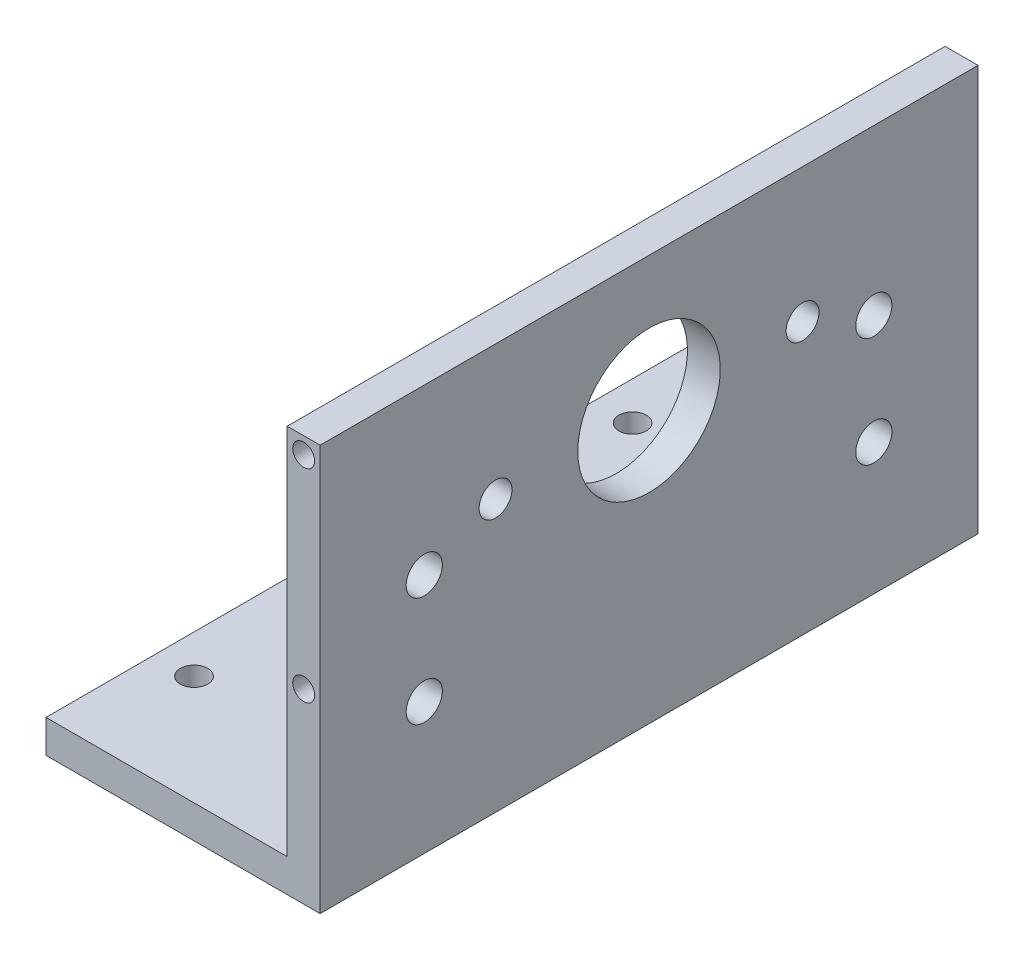
ISO-10303-21;
HEADER;
FILE_DESCRIPTION(('STEP AP214'),'2;1');
FILE_NAME('part.step','',(''),(''),'','','');
FILE_SCHEMA(('AUTOMOTIVE_DESIGN { 1 0 10303 214 1 1 1 1 }'));
ENDSEC;
DATA;
#1=APPLICATION_CONTEXT('core data for automotive mechanical design processes');
#2=APPLICATION_PROTOCOL_DEFINITION('international standard','automotive_design',2000,#1);
#3=PRODUCT_CONTEXT('',#1,'mechanical');
#4=PRODUCT('Part','Part','',(#3));
#5=PRODUCT_RELATED_PRODUCT_CATEGORY('part','',(#4));
#6=PRODUCT_DEFINITION_FORMATION('','',#4);
#7=PRODUCT_DEFINITION_CONTEXT('part definition',#1,'design');
#8=PRODUCT_DEFINITION('design','',#6,#7);
#9=PRODUCT_DEFINITION_SHAPE('','',#8);
#10=(LENGTH_UNIT() NAMED_UNIT(*) SI_UNIT(.MILLI.,.METRE.));
#11=(NAMED_UNIT(*) PLANE_ANGLE_UNIT() SI_UNIT($,.RADIAN.));
#12=(NAMED_UNIT(*) SI_UNIT($,.STERADIAN.) SOLID_ANGLE_UNIT());
#13=UNCERTAINTY_MEASURE_WITH_UNIT(LENGTH_MEASURE(1.E-05),#10,'distance_accuracy_value','');
#14=(GEOMETRIC_REPRESENTATION_CONTEXT(3) GLOBAL_UNCERTAINTY_ASSIGNED_CONTEXT((#13)) GLOBAL_UNIT_ASSIGNED_CONTEXT((#10,
#11,#12)) REPRESENTATION_CONTEXT('',''));
#15=CARTESIAN_POINT('',(0.,0.,0.));
#16=DIRECTION('',(0.,0.,1.));
#17=DIRECTION('',(1.,0.,0.));
#18=AXIS2_PLACEMENT_3D('',#15,#16,#17);
#19=CARTESIAN_POINT('',(0.,6.,60.));
#20=DIRECTION('',(0.,0.,-1.));
#21=DIRECTION('',(-1.,0.,0.));
#22=AXIS2_PLACEMENT_3D('',#19,#20,#21);
#23=PLANE('',#22);
#24=CARTESIAN_POINT('',(22.0000000000001,34.,60.));
#25=DIRECTION('',(0.,0.,-1.));
#26=DIRECTION('',(-1.,0.,0.));
#27=AXIS2_PLACEMENT_3D('',#24,#25,#26);
#28=CIRCLE('',#27,2.);
#29=CARTESIAN_POINT('',(20.0000000000001,34.,60.));
#30=VERTEX_POINT('',#29);
#31=EDGE_CURVE('E180',#30,#30,#28,.T.);
#32=ORIENTED_EDGE('',*,*,#31,.T.);
#33=EDGE_LOOP('',(#32));
#34=FACE_BOUND('',#33,.T.);
#35=DIRECTION('',(1.,0.,0.));
#36=VECTOR('',#35,1.);
#37=CARTESIAN_POINT('',(0.,0.,60.));
#38=LINE('',#37,#36);
#39=CARTESIAN_POINT('',(-25.,0.,60.));
#40=VERTEX_POINT('',#39);
#41=CARTESIAN_POINT('',(25.,0.,60.));
#42=VERTEX_POINT('',#41);
#43=EDGE_CURVE('E88',#40,#42,#38,.T.);
#44=ORIENTED_EDGE('',*,*,#43,.T.);
#45=DIRECTION('',(0.,-1.,0.));
#46=VECTOR('',#45,1.);
#47=CARTESIAN_POINT('',(25.,74.,60.));
#48=LINE('',#47,#46);
#49=CARTESIAN_POINT('',(25.,74.,60.));
#50=VERTEX_POINT('',#49);
#51=EDGE_CURVE('E108',#50,#42,#48,.T.);
#52=ORIENTED_EDGE('',*,*,#51,.F.);
#53=DIRECTION('',(1.,0.,0.));
#54=VECTOR('',#53,1.);
#55=CARTESIAN_POINT('',(0.,74.,60.));
#56=LINE('',#55,#54);
#57=CARTESIAN_POINT('',(19.,74.,60.));
#58=VERTEX_POINT('',#57);
#59=EDGE_CURVE('E130',#58,#50,#56,.T.);
#60=ORIENTED_EDGE('',*,*,#59,.F.);
#61=DIRECTION('',(0.,-1.,0.));
#62=VECTOR('',#61,1.);
#63=CARTESIAN_POINT('',(19.,74.,60.));
#64=LINE('',#63,#62);
#65=CARTESIAN_POINT('',(19.,6.00000000000001,60.));
#66=VERTEX_POINT('',#65);
#67=EDGE_CURVE('E103',#58,#66,#64,.T.);
#68=ORIENTED_EDGE('',*,*,#67,.T.);
#69=DIRECTION('',(1.,0.,0.));
#70=VECTOR('',#69,1.);
#71=CARTESIAN_POINT('',(0.,6.,60.));
#72=LINE('',#71,#70);
#73=CARTESIAN_POINT('',(-25.,6.,60.));
#74=VERTEX_POINT('',#73);
#75=EDGE_CURVE('E71',#74,#66,#72,.T.);
#76=ORIENTED_EDGE('',*,*,#75,.F.);
#77=DIRECTION('',(0.,-1.,0.));
#78=VECTOR('',#77,1.);
#79=CARTESIAN_POINT('',(-25.,6.,60.));
#80=LINE('',#79,#78);
#81=EDGE_CURVE('E48',#74,#40,#80,.T.);
#82=ORIENTED_EDGE('',*,*,#81,.T.);
#83=EDGE_LOOP('',(#44,#52,#60,#68,#76,#82));
#84=FACE_BOUND('',#83,.T.);
#85=CARTESIAN_POINT('',(22.0000000000001,71.,60.));
#86=DIRECTION('',(0.,0.,-1.));
#87=DIRECTION('',(-1.,0.,0.));
#88=AXIS2_PLACEMENT_3D('',#85,#86,#87);
#89=CIRCLE('',#88,2.);
#90=CARTESIAN_POINT('',(20.0000000000001,71.,60.));
#91=VERTEX_POINT('',#90);
#92=EDGE_CURVE('E186',#91,#91,#89,.T.);
#93=ORIENTED_EDGE('',*,*,#92,.T.);
#94=EDGE_LOOP('',(#93));
#95=FACE_BOUND('',#94,.T.);
#96=ADVANCED_FACE('F38',(#34,#84,#95),#23,.F.);
#97=CARTESIAN_POINT('',(0.,6.,-60.));
#98=DIRECTION('',(0.,0.,-1.));
#99=DIRECTION('',(-1.,0.,0.));
#100=AXIS2_PLACEMENT_3D('',#97,#98,#99);
#101=PLANE('',#100);
#102=CARTESIAN_POINT('',(22.0000000000001,71.,-60.));
#103=DIRECTION('',(0.,0.,-1.));
#104=DIRECTION('',(-1.,0.,0.));
#105=AXIS2_PLACEMENT_3D('',#102,#103,#104);
#106=CIRCLE('',#105,2.);
#107=CARTESIAN_POINT('',(20.0000000000001,71.,-60.));
#108=VERTEX_POINT('',#107);
#109=EDGE_CURVE('E174',#108,#108,#106,.T.);
#110=ORIENTED_EDGE('',*,*,#109,.F.);
#111=EDGE_LOOP('',(#110));
#112=FACE_BOUND('',#111,.T.);
#113=CARTESIAN_POINT('',(22.0000000000001,34.,-60.));
#114=DIRECTION('',(0.,0.,-1.));
#115=DIRECTION('',(-1.,0.,0.));
#116=AXIS2_PLACEMENT_3D('',#113,#114,#115);
#117=CIRCLE('',#116,2.);
#118=CARTESIAN_POINT('',(20.0000000000001,34.,-60.));
#119=VERTEX_POINT('',#118);
#120=EDGE_CURVE('E168',#119,#119,#117,.T.);
#121=ORIENTED_EDGE('',*,*,#120,.F.);
#122=EDGE_LOOP('',(#121));
#123=FACE_BOUND('',#122,.T.);
#124=DIRECTION('',(1.,0.,0.));
#125=VECTOR('',#124,1.);
#126=CARTESIAN_POINT('',(0.,0.,-60.));
#127=LINE('',#126,#125);
#128=CARTESIAN_POINT('',(-25.,0.,-60.));
#129=VERTEX_POINT('',#128);
#130=CARTESIAN_POINT('',(25.,0.,-60.));
#131=VERTEX_POINT('',#130);
#132=EDGE_CURVE('E102',#129,#131,#127,.T.);
#133=ORIENTED_EDGE('',*,*,#132,.F.);
#134=DIRECTION('',(0.,-1.,0.));
#135=VECTOR('',#134,1.);
#136=CARTESIAN_POINT('',(-25.,6.,-60.));
#137=LINE('',#136,#135);
#138=CARTESIAN_POINT('',(-25.,6.,-60.));
#139=VERTEX_POINT('',#138);
#140=EDGE_CURVE('E11',#139,#129,#137,.T.);
#141=ORIENTED_EDGE('',*,*,#140,.F.);
#142=DIRECTION('',(1.,0.,0.));
#143=VECTOR('',#142,1.);
#144=CARTESIAN_POINT('',(0.,6.,-60.));
#145=LINE('',#144,#143);
#146=CARTESIAN_POINT('',(19.,6.,-60.));
#147=VERTEX_POINT('',#146);
#148=EDGE_CURVE('E83',#139,#147,#145,.T.);
#149=ORIENTED_EDGE('',*,*,#148,.T.);
#150=DIRECTION('',(0.,-1.,0.));
#151=VECTOR('',#150,1.);
#152=CARTESIAN_POINT('',(19.,74.,-60.));
#153=LINE('',#152,#151);
#154=CARTESIAN_POINT('',(19.,74.,-60.));
#155=VERTEX_POINT('',#154);
#156=EDGE_CURVE('E94',#155,#147,#153,.T.);
#157=ORIENTED_EDGE('',*,*,#156,.F.);
#158=DIRECTION('',(1.,0.,0.));
#159=VECTOR('',#158,1.);
#160=CARTESIAN_POINT('',(0.,74.,-60.));
#161=LINE('',#160,#159);
#162=CARTESIAN_POINT('',(25.,74.,-60.));
#163=VERTEX_POINT('',#162);
#164=EDGE_CURVE('E127',#155,#163,#161,.T.);
#165=ORIENTED_EDGE('',*,*,#164,.T.);
#166=DIRECTION('',(0.,-1.,0.));
#167=VECTOR('',#166,1.);
#168=CARTESIAN_POINT('',(25.,74.,-60.));
#169=LINE('',#168,#167);
#170=EDGE_CURVE('E120',#163,#131,#169,.T.);
#171=ORIENTED_EDGE('',*,*,#170,.T.);
#172=EDGE_LOOP('',(#133,#141,#149,#157,#165,#171));
#173=FACE_BOUND('',#172,.T.);
#174=ADVANCED_FACE('F40',(#112,#123,#173),#101,.T.);
#175=CARTESIAN_POINT('',(-25.,6.,0.));
#176=DIRECTION('',(-1.,0.,0.));
#177=DIRECTION('',(0.,0.,1.));
#178=AXIS2_PLACEMENT_3D('',#175,#176,#177);
#179=PLANE('',#178);
#180=DIRECTION('',(0.,0.,-1.));
#181=VECTOR('',#180,1.);
#182=CARTESIAN_POINT('',(-25.,0.,0.));
#183=LINE('',#182,#181);
#184=EDGE_CURVE('E106',#40,#129,#183,.T.);
#185=ORIENTED_EDGE('',*,*,#184,.F.);
#186=ORIENTED_EDGE('',*,*,#81,.F.);
#187=DIRECTION('',(0.,0.,-1.));
#188=VECTOR('',#187,1.);
#189=CARTESIAN_POINT('',(-25.,6.,0.));
#190=LINE('',#189,#188);
#191=EDGE_CURVE('E96',#74,#139,#190,.T.);
#192=ORIENTED_EDGE('',*,*,#191,.T.);
#193=ORIENTED_EDGE('',*,*,#140,.T.);
#194=EDGE_LOOP('',(#185,#186,#192,#193));
#195=FACE_BOUND('',#194,.T.);
#196=ADVANCED_FACE('F331',(#195),#179,.T.);
#197=CARTESIAN_POINT('',(0.,6.,0.));
#198=DIRECTION('',(0.,1.,0.));
#199=DIRECTION('',(0.,0.,1.));
#200=AXIS2_PLACEMENT_3D('',#197,#198,#199);
#201=PLANE('',#200);
#202=CARTESIAN_POINT('',(12.,6.,40.));
#203=DIRECTION('',(0.,1.,0.));
#204=DIRECTION('',(0.,0.,1.));
#205=AXIS2_PLACEMENT_3D('',#202,#203,#204);
#206=CIRCLE('',#205,2.5);
#207=CARTESIAN_POINT('',(12.,6.,42.5));
#208=VERTEX_POINT('',#207);
#209=EDGE_CURVE('E164',#208,#208,#206,.T.);
#210=ORIENTED_EDGE('',*,*,#209,.F.);
#211=EDGE_LOOP('',(#210));
#212=FACE_BOUND('',#211,.T.);
#213=CARTESIAN_POINT('',(-18.,6.,40.));
#214=DIRECTION('',(0.,1.,0.));
#215=DIRECTION('',(0.,0.,1.));
#216=AXIS2_PLACEMENT_3D('',#213,#214,#215);
#217=CIRCLE('',#216,2.5);
#218=CARTESIAN_POINT('',(-18.,6.,42.5));
#219=VERTEX_POINT('',#218);
#220=EDGE_CURVE('E161',#219,#219,#217,.T.);
#221=ORIENTED_EDGE('',*,*,#220,.F.);
#222=EDGE_LOOP('',(#221));
#223=FACE_BOUND('',#222,.T.);
#224=CARTESIAN_POINT('',(12.,6.,-40.));
#225=DIRECTION('',(0.,1.,0.));
#226=DIRECTION('',(0.,0.,1.));
#227=AXIS2_PLACEMENT_3D('',#224,#225,#226);
#228=CIRCLE('',#227,2.5);
#229=CARTESIAN_POINT('',(12.,6.,-37.5));
#230=VERTEX_POINT('',#229);
#231=EDGE_CURVE('E157',#230,#230,#228,.T.);
#232=ORIENTED_EDGE('',*,*,#231,.F.);
#233=EDGE_LOOP('',(#232));
#234=FACE_BOUND('',#233,.T.);
#235=CARTESIAN_POINT('',(-18.,6.,-40.));
#236=DIRECTION('',(0.,1.,0.));
#237=DIRECTION('',(0.,0.,1.));
#238=AXIS2_PLACEMENT_3D('',#235,#236,#237);
#239=CIRCLE('',#238,2.5);
#240=CARTESIAN_POINT('',(-18.,6.,-37.5));
#241=VERTEX_POINT('',#240);
#242=EDGE_CURVE('E153',#241,#241,#239,.T.);
#243=ORIENTED_EDGE('',*,*,#242,.F.);
#244=EDGE_LOOP('',(#243));
#245=FACE_BOUND('',#244,.T.);
#246=DIRECTION('',(0.,0.,1.));
#247=VECTOR('',#246,1.);
#248=CARTESIAN_POINT('',(19.,6.,0.));
#249=LINE('',#248,#247);
#250=EDGE_CURVE('E80',#147,#66,#249,.T.);
#251=ORIENTED_EDGE('',*,*,#250,.F.);
#252=ORIENTED_EDGE('',*,*,#148,.F.);
#253=ORIENTED_EDGE('',*,*,#191,.F.);
#254=ORIENTED_EDGE('',*,*,#75,.T.);
#255=EDGE_LOOP('',(#251,#252,#253,#254));
#256=FACE_BOUND('',#255,.T.);
#257=ADVANCED_FACE('F82',(#212,#223,#234,#245,#256),#201,.T.);
#258=CARTESIAN_POINT('',(0.,0.,0.));
#259=DIRECTION('',(0.,1.,0.));
#260=DIRECTION('',(0.,0.,1.));
#261=AXIS2_PLACEMENT_3D('',#258,#259,#260);
#262=PLANE('',#261);
#263=CARTESIAN_POINT('',(12.,0.,40.));
#264=DIRECTION('',(0.,1.,0.));
#265=DIRECTION('',(0.,0.,1.));
#266=AXIS2_PLACEMENT_3D('',#263,#264,#265);
#267=CIRCLE('',#266,2.5);
#268=CARTESIAN_POINT('',(12.,0.,42.5));
#269=VERTEX_POINT('',#268);
#270=EDGE_CURVE('E42',#269,#269,#267,.T.);
#271=ORIENTED_EDGE('',*,*,#270,.T.);
#272=EDGE_LOOP('',(#271));
#273=FACE_BOUND('',#272,.T.);
#274=CARTESIAN_POINT('',(-18.,0.,40.));
#275=DIRECTION('',(0.,1.,0.));
#276=DIRECTION('',(0.,0.,1.));
#277=AXIS2_PLACEMENT_3D('',#274,#275,#276);
#278=CIRCLE('',#277,2.5);
#279=CARTESIAN_POINT('',(-18.,0.,42.5));
#280=VERTEX_POINT('',#279);
#281=EDGE_CURVE('E160',#280,#280,#278,.T.);
#282=ORIENTED_EDGE('',*,*,#281,.T.);
#283=EDGE_LOOP('',(#282));
#284=FACE_BOUND('',#283,.T.);
#285=CARTESIAN_POINT('',(12.,0.,-40.));
#286=DIRECTION('',(0.,1.,0.));
#287=DIRECTION('',(0.,0.,1.));
#288=AXIS2_PLACEMENT_3D('',#285,#286,#287);
#289=CIRCLE('',#288,2.5);
#290=CARTESIAN_POINT('',(12.,0.,-37.5));
#291=VERTEX_POINT('',#290);
#292=EDGE_CURVE('E156',#291,#291,#289,.T.);
#293=ORIENTED_EDGE('',*,*,#292,.T.);
#294=EDGE_LOOP('',(#293));
#295=FACE_BOUND('',#294,.T.);
#296=CARTESIAN_POINT('',(-18.,0.,-40.));
#297=DIRECTION('',(0.,1.,0.));
#298=DIRECTION('',(0.,0.,1.));
#299=AXIS2_PLACEMENT_3D('',#296,#297,#298);
#300=CIRCLE('',#299,2.5);
#301=CARTESIAN_POINT('',(-18.,0.,-37.5));
#302=VERTEX_POINT('',#301);
#303=EDGE_CURVE('E150',#302,#302,#300,.T.);
#304=ORIENTED_EDGE('',*,*,#303,.T.);
#305=EDGE_LOOP('',(#304));
#306=FACE_BOUND('',#305,.T.);
#307=ORIENTED_EDGE('',*,*,#132,.T.);
#308=DIRECTION('',(0.,0.,-1.));
#309=VECTOR('',#308,1.);
#310=CARTESIAN_POINT('',(25.,0.,0.));
#311=LINE('',#310,#309);
#312=EDGE_CURVE('E124',#42,#131,#311,.T.);
#313=ORIENTED_EDGE('',*,*,#312,.F.);
#314=ORIENTED_EDGE('',*,*,#43,.F.);
#315=ORIENTED_EDGE('',*,*,#184,.T.);
#316=EDGE_LOOP('',(#307,#313,#314,#315));
#317=FACE_BOUND('',#316,.T.);
#318=ADVANCED_FACE('F243',(#273,#284,#295,#306,#317),#262,.F.);
#319=CARTESIAN_POINT('',(19.,74.,0.));
#320=DIRECTION('',(1.,0.,0.));
#321=DIRECTION('',(0.,0.,-1.));
#322=AXIS2_PLACEMENT_3D('',#319,#320,#321);
#323=PLANE('',#322);
#324=CARTESIAN_POINT('',(19.,44.,41.));
#325=DIRECTION('',(1.,0.,0.));
#326=DIRECTION('',(0.,0.,-1.));
#327=AXIS2_PLACEMENT_3D('',#324,#325,#326);
#328=CIRCLE('',#327,3.30000000000001);
#329=CARTESIAN_POINT('',(19.,44.,37.7));
#330=VERTEX_POINT('',#329);
#331=EDGE_CURVE('E209',#330,#330,#328,.T.);
#332=ORIENTED_EDGE('',*,*,#331,.T.);
#333=EDGE_LOOP('',(#332));
#334=FACE_BOUND('',#333,.T.);
#335=CARTESIAN_POINT('',(19.,24.,41.));
#336=DIRECTION('',(1.,0.,0.));
#337=DIRECTION('',(0.,0.,-1.));
#338=AXIS2_PLACEMENT_3D('',#335,#336,#337);
#339=CIRCLE('',#338,3.3);
#340=CARTESIAN_POINT('',(19.,24.,37.7));
#341=VERTEX_POINT('',#340);
#342=EDGE_CURVE('E203',#341,#341,#339,.T.);
#343=ORIENTED_EDGE('',*,*,#342,.T.);
#344=EDGE_LOOP('',(#343));
#345=FACE_BOUND('',#344,.T.);
#346=CARTESIAN_POINT('',(19.,24.,-41.));
#347=DIRECTION('',(1.,0.,0.));
#348=DIRECTION('',(0.,0.,-1.));
#349=AXIS2_PLACEMENT_3D('',#346,#347,#348);
#350=CIRCLE('',#349,3.3);
#351=CARTESIAN_POINT('',(19.,24.,-44.3));
#352=VERTEX_POINT('',#351);
#353=EDGE_CURVE('E197',#352,#352,#350,.T.);
#354=ORIENTED_EDGE('',*,*,#353,.T.);
#355=EDGE_LOOP('',(#354));
#356=FACE_BOUND('',#355,.T.);
#357=CARTESIAN_POINT('',(19.,44.,-41.));
#358=DIRECTION('',(1.,0.,0.));
#359=DIRECTION('',(0.,0.,-1.));
#360=AXIS2_PLACEMENT_3D('',#357,#358,#359);
#361=CIRCLE('',#360,3.30000000000001);
#362=CARTESIAN_POINT('',(19.,44.,-44.3));
#363=VERTEX_POINT('',#362);
#364=EDGE_CURVE('E189',#363,#363,#361,.T.);
#365=ORIENTED_EDGE('',*,*,#364,.T.);
#366=EDGE_LOOP('',(#365));
#367=FACE_BOUND('',#366,.T.);
#368=CARTESIAN_POINT('',(19.,49.5,28.));
#369=DIRECTION('',(-1.,0.,0.));
#370=DIRECTION('',(0.,0.,-1.));
#371=AXIS2_PLACEMENT_3D('',#368,#369,#370);
#372=CIRCLE('',#371,3.);
#373=CARTESIAN_POINT('',(19.,49.5,25.));
#374=VERTEX_POINT('',#373);
#375=EDGE_CURVE('E147',#374,#374,#372,.T.);
#376=ORIENTED_EDGE('',*,*,#375,.F.);
#377=EDGE_LOOP('',(#376));
#378=FACE_BOUND('',#377,.T.);
#379=CARTESIAN_POINT('',(19.,49.5,-28.));
#380=DIRECTION('',(-1.,0.,0.));
#381=DIRECTION('',(0.,0.,1.));
#382=AXIS2_PLACEMENT_3D('',#379,#380,#381);
#383=CIRCLE('',#382,3.);
#384=CARTESIAN_POINT('',(19.,49.5,-25.));
#385=VERTEX_POINT('',#384);
#386=EDGE_CURVE('E141',#385,#385,#383,.T.);
#387=ORIENTED_EDGE('',*,*,#386,.F.);
#388=EDGE_LOOP('',(#387));
#389=FACE_BOUND('',#388,.T.);
#390=CARTESIAN_POINT('',(19.,49.5,0.));
#391=DIRECTION('',(-1.,0.,0.));
#392=DIRECTION('',(0.,0.,1.));
#393=AXIS2_PLACEMENT_3D('',#390,#391,#392);
#394=CIRCLE('',#393,13.);
#395=CARTESIAN_POINT('',(19.,49.5,13.));
#396=VERTEX_POINT('',#395);
#397=EDGE_CURVE('E135',#396,#396,#394,.T.);
#398=ORIENTED_EDGE('',*,*,#397,.F.);
#399=EDGE_LOOP('',(#398));
#400=FACE_BOUND('',#399,.T.);
#401=ORIENTED_EDGE('',*,*,#156,.T.);
#402=ORIENTED_EDGE('',*,*,#250,.T.);
#403=ORIENTED_EDGE('',*,*,#67,.F.);
#404=DIRECTION('',(0.,0.,1.));
#405=VECTOR('',#404,1.);
#406=CARTESIAN_POINT('',(19.,74.,0.));
#407=LINE('',#406,#405);
#408=EDGE_CURVE('E100',#155,#58,#407,.T.);
#409=ORIENTED_EDGE('',*,*,#408,.F.);
#410=EDGE_LOOP('',(#401,#402,#403,#409));
#411=FACE_BOUND('',#410,.T.);
#412=ADVANCED_FACE('F98',(#334,#345,#356,#367,#378,#389,#400,#411),#323,.F.);
#413=CARTESIAN_POINT('',(25.,74.,0.));
#414=DIRECTION('',(-1.,0.,0.));
#415=DIRECTION('',(0.,0.,1.));
#416=AXIS2_PLACEMENT_3D('',#413,#414,#415);
#417=PLANE('',#416);
#418=CARTESIAN_POINT('',(25.,44.,41.));
#419=DIRECTION('',(1.,0.,0.));
#420=DIRECTION('',(0.,0.,1.));
#421=AXIS2_PLACEMENT_3D('',#418,#419,#420);
#422=CIRCLE('',#421,3.30000000000001);
#423=CARTESIAN_POINT('',(25.,44.,44.3));
#424=VERTEX_POINT('',#423);
#425=EDGE_CURVE('E212',#424,#424,#422,.T.);
#426=ORIENTED_EDGE('',*,*,#425,.F.);
#427=EDGE_LOOP('',(#426));
#428=FACE_BOUND('',#427,.T.);
#429=CARTESIAN_POINT('',(25.,24.,41.));
#430=DIRECTION('',(1.,0.,0.));
#431=DIRECTION('',(0.,0.,-1.));
#432=AXIS2_PLACEMENT_3D('',#429,#430,#431);
#433=CIRCLE('',#432,3.3);
#434=CARTESIAN_POINT('',(25.,24.,37.7));
#435=VERTEX_POINT('',#434);
#436=EDGE_CURVE('E206',#435,#435,#433,.T.);
#437=ORIENTED_EDGE('',*,*,#436,.F.);
#438=EDGE_LOOP('',(#437));
#439=FACE_BOUND('',#438,.T.);
#440=CARTESIAN_POINT('',(25.,24.,-41.));
#441=DIRECTION('',(1.,0.,0.));
#442=DIRECTION('',(0.,0.,1.));
#443=AXIS2_PLACEMENT_3D('',#440,#441,#442);
#444=CIRCLE('',#443,3.3);
#445=CARTESIAN_POINT('',(25.,24.,-37.7));
#446=VERTEX_POINT('',#445);
#447=EDGE_CURVE('E200',#446,#446,#444,.T.);
#448=ORIENTED_EDGE('',*,*,#447,.F.);
#449=EDGE_LOOP('',(#448));
#450=FACE_BOUND('',#449,.T.);
#451=CARTESIAN_POINT('',(25.,44.,-41.));
#452=DIRECTION('',(1.,0.,0.));
#453=DIRECTION('',(0.,0.,-1.));
#454=AXIS2_PLACEMENT_3D('',#451,#452,#453);
#455=CIRCLE('',#454,3.30000000000001);
#456=CARTESIAN_POINT('',(25.,44.,-44.3));
#457=VERTEX_POINT('',#456);
#458=EDGE_CURVE('E194',#457,#457,#455,.T.);
#459=ORIENTED_EDGE('',*,*,#458,.F.);
#460=EDGE_LOOP('',(#459));
#461=FACE_BOUND('',#460,.T.);
#462=CARTESIAN_POINT('',(25.,49.5,28.));
#463=DIRECTION('',(-1.,0.,0.));
#464=DIRECTION('',(0.,0.,-1.));
#465=AXIS2_PLACEMENT_3D('',#462,#463,#464);
#466=CIRCLE('',#465,3.);
#467=CARTESIAN_POINT('',(25.,49.5,25.));
#468=VERTEX_POINT('',#467);
#469=EDGE_CURVE('E144',#468,#468,#466,.T.);
#470=ORIENTED_EDGE('',*,*,#469,.T.);
#471=EDGE_LOOP('',(#470));
#472=FACE_BOUND('',#471,.T.);
#473=CARTESIAN_POINT('',(25.,49.5,-28.));
#474=DIRECTION('',(-1.,0.,0.));
#475=DIRECTION('',(0.,0.,1.));
#476=AXIS2_PLACEMENT_3D('',#473,#474,#475);
#477=CIRCLE('',#476,3.);
#478=CARTESIAN_POINT('',(25.,49.5,-25.));
#479=VERTEX_POINT('',#478);
#480=EDGE_CURVE('E138',#479,#479,#477,.T.);
#481=ORIENTED_EDGE('',*,*,#480,.T.);
#482=EDGE_LOOP('',(#481));
#483=FACE_BOUND('',#482,.T.);
#484=CARTESIAN_POINT('',(25.,49.5,0.));
#485=DIRECTION('',(-1.,0.,0.));
#486=DIRECTION('',(0.,0.,1.));
#487=AXIS2_PLACEMENT_3D('',#484,#485,#486);
#488=CIRCLE('',#487,13.);
#489=CARTESIAN_POINT('',(25.,49.5,13.));
#490=VERTEX_POINT('',#489);
#491=EDGE_CURVE('E128',#490,#490,#488,.T.);
#492=ORIENTED_EDGE('',*,*,#491,.T.);
#493=EDGE_LOOP('',(#492));
#494=FACE_BOUND('',#493,.T.);
#495=ORIENTED_EDGE('',*,*,#312,.T.);
#496=ORIENTED_EDGE('',*,*,#170,.F.);
#497=DIRECTION('',(0.,0.,-1.));
#498=VECTOR('',#497,1.);
#499=CARTESIAN_POINT('',(25.,74.,0.));
#500=LINE('',#499,#498);
#501=EDGE_CURVE('E123',#50,#163,#500,.T.);
#502=ORIENTED_EDGE('',*,*,#501,.F.);
#503=ORIENTED_EDGE('',*,*,#51,.T.);
#504=EDGE_LOOP('',(#495,#496,#502,#503));
#505=FACE_BOUND('',#504,.T.);
#506=ADVANCED_FACE('F219',(#428,#439,#450,#461,#472,#483,#494,#505),#417,.F.);
#507=CARTESIAN_POINT('',(0.,74.,0.));
#508=DIRECTION('',(0.,1.,0.));
#509=DIRECTION('',(0.,0.,1.));
#510=AXIS2_PLACEMENT_3D('',#507,#508,#509);
#511=PLANE('',#510);
#512=ORIENTED_EDGE('',*,*,#164,.F.);
#513=ORIENTED_EDGE('',*,*,#408,.T.);
#514=ORIENTED_EDGE('',*,*,#59,.T.);
#515=ORIENTED_EDGE('',*,*,#501,.T.);
#516=EDGE_LOOP('',(#512,#513,#514,#515));
#517=FACE_BOUND('',#516,.T.);
#518=ADVANCED_FACE('F222',(#517),#511,.T.);
#519=CARTESIAN_POINT('',(25.,49.5,0.));
#520=DIRECTION('',(-1.,0.,0.));
#521=DIRECTION('',(0.,0.,1.));
#522=AXIS2_PLACEMENT_3D('',#519,#520,#521);
#523=CYLINDRICAL_SURFACE('',#522,13.);
#524=ORIENTED_EDGE('',*,*,#491,.F.);
#525=EDGE_LOOP('',(#524));
#526=FACE_BOUND('',#525,.T.);
#527=ORIENTED_EDGE('',*,*,#397,.T.);
#528=EDGE_LOOP('',(#527));
#529=FACE_BOUND('',#528,.T.);
#530=ADVANCED_FACE('F319',(#526,#529),#523,.F.);
#531=CARTESIAN_POINT('',(25.,49.5,-28.));
#532=DIRECTION('',(-1.,0.,0.));
#533=DIRECTION('',(0.,0.,1.));
#534=AXIS2_PLACEMENT_3D('',#531,#532,#533);
#535=CYLINDRICAL_SURFACE('',#534,3.);
#536=ORIENTED_EDGE('',*,*,#480,.F.);
#537=EDGE_LOOP('',(#536));
#538=FACE_BOUND('',#537,.T.);
#539=ORIENTED_EDGE('',*,*,#386,.T.);
#540=EDGE_LOOP('',(#539));
#541=FACE_BOUND('',#540,.T.);
#542=ADVANCED_FACE('F315',(#538,#541),#535,.F.);
#543=CARTESIAN_POINT('',(25.,49.5,28.));
#544=DIRECTION('',(-1.,0.,0.));
#545=DIRECTION('',(0.,0.,1.));
#546=AXIS2_PLACEMENT_3D('',#543,#544,#545);
#547=CYLINDRICAL_SURFACE('',#546,3.);
#548=ORIENTED_EDGE('',*,*,#469,.F.);
#549=EDGE_LOOP('',(#548));
#550=FACE_BOUND('',#549,.T.);
#551=ORIENTED_EDGE('',*,*,#375,.T.);
#552=EDGE_LOOP('',(#551));
#553=FACE_BOUND('',#552,.T.);
#554=ADVANCED_FACE('F311',(#550,#553),#547,.F.);
#555=CARTESIAN_POINT('',(-18.,-4.,-40.));
#556=DIRECTION('',(0.,1.,0.));
#557=DIRECTION('',(0.,0.,1.));
#558=AXIS2_PLACEMENT_3D('',#555,#556,#557);
#559=CYLINDRICAL_SURFACE('',#558,2.5);
#560=ORIENTED_EDGE('',*,*,#242,.T.);
#561=EDGE_LOOP('',(#560));
#562=FACE_BOUND('',#561,.T.);
#563=ORIENTED_EDGE('',*,*,#303,.F.);
#564=EDGE_LOOP('',(#563));
#565=FACE_BOUND('',#564,.T.);
#566=ADVANCED_FACE('F307',(#562,#565),#559,.F.);
#567=CARTESIAN_POINT('',(12.,-4.,-40.));
#568=DIRECTION('',(0.,1.,0.));
#569=DIRECTION('',(0.,0.,1.));
#570=AXIS2_PLACEMENT_3D('',#567,#568,#569);
#571=CYLINDRICAL_SURFACE('',#570,2.5);
#572=ORIENTED_EDGE('',*,*,#231,.T.);
#573=EDGE_LOOP('',(#572));
#574=FACE_BOUND('',#573,.T.);
#575=ORIENTED_EDGE('',*,*,#292,.F.);
#576=EDGE_LOOP('',(#575));
#577=FACE_BOUND('',#576,.T.);
#578=ADVANCED_FACE('F303',(#574,#577),#571,.F.);
#579=CARTESIAN_POINT('',(-18.,-4.,40.));
#580=DIRECTION('',(0.,1.,0.));
#581=DIRECTION('',(0.,0.,1.));
#582=AXIS2_PLACEMENT_3D('',#579,#580,#581);
#583=CYLINDRICAL_SURFACE('',#582,2.5);
#584=ORIENTED_EDGE('',*,*,#220,.T.);
#585=EDGE_LOOP('',(#584));
#586=FACE_BOUND('',#585,.T.);
#587=ORIENTED_EDGE('',*,*,#281,.F.);
#588=EDGE_LOOP('',(#587));
#589=FACE_BOUND('',#588,.T.);
#590=ADVANCED_FACE('F299',(#586,#589),#583,.F.);
#591=CARTESIAN_POINT('',(12.,-4.,40.));
#592=DIRECTION('',(0.,1.,0.));
#593=DIRECTION('',(0.,0.,1.));
#594=AXIS2_PLACEMENT_3D('',#591,#592,#593);
#595=CYLINDRICAL_SURFACE('',#594,2.5);
#596=ORIENTED_EDGE('',*,*,#209,.T.);
#597=EDGE_LOOP('',(#596));
#598=FACE_BOUND('',#597,.T.);
#599=ORIENTED_EDGE('',*,*,#270,.F.);
#600=EDGE_LOOP('',(#599));
#601=FACE_BOUND('',#600,.T.);
#602=ADVANCED_FACE('F295',(#598,#601),#595,.F.);
#603=CARTESIAN_POINT('',(22.0000000000001,34.,-40.));
#604=DIRECTION('',(0.,0.,-1.));
#605=DIRECTION('',(-1.,0.,0.));
#606=AXIS2_PLACEMENT_3D('',#603,#604,#605);
#607=CYLINDRICAL_SURFACE('',#606,2.);
#608=CARTESIAN_POINT('',(22.0000000000001,34.,-40.));
#609=DIRECTION('',(0.,0.,-1.));
#610=DIRECTION('',(-1.,0.,0.));
#611=AXIS2_PLACEMENT_3D('',#608,#609,#610);
#612=CIRCLE('',#611,2.);
#613=CARTESIAN_POINT('',(20.0000000000001,34.,-40.));
#614=VERTEX_POINT('',#613);
#615=EDGE_CURVE('E167',#614,#614,#612,.T.);
#616=ORIENTED_EDGE('',*,*,#615,.F.);
#617=EDGE_LOOP('',(#616));
#618=FACE_BOUND('',#617,.T.);
#619=ORIENTED_EDGE('',*,*,#120,.T.);
#620=EDGE_LOOP('',(#619));
#621=FACE_BOUND('',#620,.T.);
#622=ADVANCED_FACE('F291',(#618,#621),#607,.F.);
#623=CARTESIAN_POINT('',(22.0000000000001,34.,-40.));
#624=DIRECTION('',(0.,0.,-1.));
#625=DIRECTION('',(-1.,0.,0.));
#626=AXIS2_PLACEMENT_3D('',#623,#624,#625);
#627=PLANE('',#626);
#628=ORIENTED_EDGE('',*,*,#615,.T.);
#629=EDGE_LOOP('',(#628));
#630=FACE_BOUND('',#629,.T.);
#631=ADVANCED_FACE('F287',(#630),#627,.T.);
#632=CARTESIAN_POINT('',(22.0000000000001,71.,-40.));
#633=DIRECTION('',(0.,0.,-1.));
#634=DIRECTION('',(-1.,0.,0.));
#635=AXIS2_PLACEMENT_3D('',#632,#633,#634);
#636=CYLINDRICAL_SURFACE('',#635,2.);
#637=CARTESIAN_POINT('',(22.0000000000001,71.,-40.));
#638=DIRECTION('',(0.,0.,-1.));
#639=DIRECTION('',(-1.,0.,0.));
#640=AXIS2_PLACEMENT_3D('',#637,#638,#639);
#641=CIRCLE('',#640,2.);
#642=CARTESIAN_POINT('',(20.0000000000001,71.,-40.));
#643=VERTEX_POINT('',#642);
#644=EDGE_CURVE('E171',#643,#643,#641,.T.);
#645=ORIENTED_EDGE('',*,*,#644,.F.);
#646=EDGE_LOOP('',(#645));
#647=FACE_BOUND('',#646,.T.);
#648=ORIENTED_EDGE('',*,*,#109,.T.);
#649=EDGE_LOOP('',(#648));
#650=FACE_BOUND('',#649,.T.);
#651=ADVANCED_FACE('F283',(#647,#650),#636,.F.);
#652=CARTESIAN_POINT('',(22.0000000000001,71.,-40.));
#653=DIRECTION('',(0.,0.,-1.));
#654=DIRECTION('',(-1.,0.,0.));
#655=AXIS2_PLACEMENT_3D('',#652,#653,#654);
#656=PLANE('',#655);
#657=ORIENTED_EDGE('',*,*,#644,.T.);
#658=EDGE_LOOP('',(#657));
#659=FACE_BOUND('',#658,.T.);
#660=ADVANCED_FACE('F279',(#659),#656,.T.);
#661=CARTESIAN_POINT('',(22.0000000000001,34.,40.));
#662=DIRECTION('',(0.,0.,1.));
#663=DIRECTION('',(1.,0.,0.));
#664=AXIS2_PLACEMENT_3D('',#661,#662,#663);
#665=CYLINDRICAL_SURFACE('',#664,2.);
#666=CARTESIAN_POINT('',(22.0000000000001,34.,40.));
#667=DIRECTION('',(0.,0.,-1.));
#668=DIRECTION('',(-1.,0.,0.));
#669=AXIS2_PLACEMENT_3D('',#666,#667,#668);
#670=CIRCLE('',#669,2.);
#671=CARTESIAN_POINT('',(20.0000000000001,34.,40.));
#672=VERTEX_POINT('',#671);
#673=EDGE_CURVE('E177',#672,#672,#670,.T.);
#674=ORIENTED_EDGE('',*,*,#673,.T.);
#675=EDGE_LOOP('',(#674));
#676=FACE_BOUND('',#675,.T.);
#677=ORIENTED_EDGE('',*,*,#31,.F.);
#678=EDGE_LOOP('',(#677));
#679=FACE_BOUND('',#678,.T.);
#680=ADVANCED_FACE('F272',(#676,#679),#665,.F.);
#681=CARTESIAN_POINT('',(22.0000000000001,34.,40.));
#682=DIRECTION('',(0.,0.,1.));
#683=DIRECTION('',(-1.,0.,0.));
#684=AXIS2_PLACEMENT_3D('',#681,#682,#683);
#685=PLANE('',#684);
#686=ORIENTED_EDGE('',*,*,#673,.F.);
#687=EDGE_LOOP('',(#686));
#688=FACE_BOUND('',#687,.T.);
#689=ADVANCED_FACE('F262',(#688),#685,.T.);
#690=CARTESIAN_POINT('',(22.0000000000001,71.,40.));
#691=DIRECTION('',(0.,0.,1.));
#692=DIRECTION('',(1.,0.,0.));
#693=AXIS2_PLACEMENT_3D('',#690,#691,#692);
#694=CYLINDRICAL_SURFACE('',#693,2.);
#695=CARTESIAN_POINT('',(22.0000000000001,71.,40.));
#696=DIRECTION('',(0.,0.,-1.));
#697=DIRECTION('',(-1.,0.,0.));
#698=AXIS2_PLACEMENT_3D('',#695,#696,#697);
#699=CIRCLE('',#698,2.);
#700=CARTESIAN_POINT('',(20.0000000000001,71.,40.));
#701=VERTEX_POINT('',#700);
#702=EDGE_CURVE('E183',#701,#701,#699,.T.);
#703=ORIENTED_EDGE('',*,*,#702,.T.);
#704=EDGE_LOOP('',(#703));
#705=FACE_BOUND('',#704,.T.);
#706=ORIENTED_EDGE('',*,*,#92,.F.);
#707=EDGE_LOOP('',(#706));
#708=FACE_BOUND('',#707,.T.);
#709=ADVANCED_FACE('F259',(#705,#708),#694,.F.);
#710=CARTESIAN_POINT('',(22.0000000000001,71.,40.));
#711=DIRECTION('',(0.,0.,1.));
#712=DIRECTION('',(-1.,0.,0.));
#713=AXIS2_PLACEMENT_3D('',#710,#711,#712);
#714=PLANE('',#713);
#715=ORIENTED_EDGE('',*,*,#702,.F.);
#716=EDGE_LOOP('',(#715));
#717=FACE_BOUND('',#716,.T.);
#718=ADVANCED_FACE('F261',(#717),#714,.T.);
#719=CARTESIAN_POINT('',(15.,44.,-41.));
#720=DIRECTION('',(1.,0.,0.));
#721=DIRECTION('',(0.,0.,-1.));
#722=AXIS2_PLACEMENT_3D('',#719,#720,#721);
#723=CYLINDRICAL_SURFACE('',#722,3.30000000000001);
#724=ORIENTED_EDGE('',*,*,#458,.T.);
#725=EDGE_LOOP('',(#724));
#726=FACE_BOUND('',#725,.T.);
#727=ORIENTED_EDGE('',*,*,#364,.F.);
#728=EDGE_LOOP('',(#727));
#729=FACE_BOUND('',#728,.T.);
#730=ADVANCED_FACE('F269',(#726,#729),#723,.F.);
#731=CARTESIAN_POINT('',(15.,24.,-41.));
#732=DIRECTION('',(1.,0.,0.));
#733=DIRECTION('',(0.,0.,-1.));
#734=AXIS2_PLACEMENT_3D('',#731,#732,#733);
#735=CYLINDRICAL_SURFACE('',#734,3.3);
#736=ORIENTED_EDGE('',*,*,#447,.T.);
#737=EDGE_LOOP('',(#736));
#738=FACE_BOUND('',#737,.T.);
#739=ORIENTED_EDGE('',*,*,#353,.F.);
#740=EDGE_LOOP('',(#739));
#741=FACE_BOUND('',#740,.T.);
#742=ADVANCED_FACE('F426',(#738,#741),#735,.F.);
#743=CARTESIAN_POINT('',(15.,24.,41.));
#744=DIRECTION('',(1.,0.,0.));
#745=DIRECTION('',(0.,0.,-1.));
#746=AXIS2_PLACEMENT_3D('',#743,#744,#745);
#747=CYLINDRICAL_SURFACE('',#746,3.3);
#748=ORIENTED_EDGE('',*,*,#436,.T.);
#749=EDGE_LOOP('',(#748));
#750=FACE_BOUND('',#749,.T.);
#751=ORIENTED_EDGE('',*,*,#342,.F.);
#752=EDGE_LOOP('',(#751));
#753=FACE_BOUND('',#752,.T.);
#754=ADVANCED_FACE('F435',(#750,#753),#747,.F.);
#755=CARTESIAN_POINT('',(15.,44.,41.));
#756=DIRECTION('',(1.,0.,0.));
#757=DIRECTION('',(0.,0.,-1.));
#758=AXIS2_PLACEMENT_3D('',#755,#756,#757);
#759=CYLINDRICAL_SURFACE('',#758,3.30000000000001);
#760=ORIENTED_EDGE('',*,*,#425,.T.);
#761=EDGE_LOOP('',(#760));
#762=FACE_BOUND('',#761,.T.);
#763=ORIENTED_EDGE('',*,*,#331,.F.);
#764=EDGE_LOOP('',(#763));
#765=FACE_BOUND('',#764,.T.);
#766=ADVANCED_FACE('F216',(#762,#765),#759,.F.);
#767=CLOSED_SHELL('',(#96,#174,#196,#257,#318,#412,#506,#518,#530,#542,#554,#566,#578,#590,#602,
#622,#631,#651,#660,#680,#689,#709,#718,#730,#742,#754,#766));
#768=MANIFOLD_SOLID_BREP('B2',#767);
#769=ADVANCED_BREP_SHAPE_REPRESENTATION('',(#18,#768),#14);
#770=SHAPE_DEFINITION_REPRESENTATION(#9,#769);
ENDSEC;
END-ISO-10303-21;
